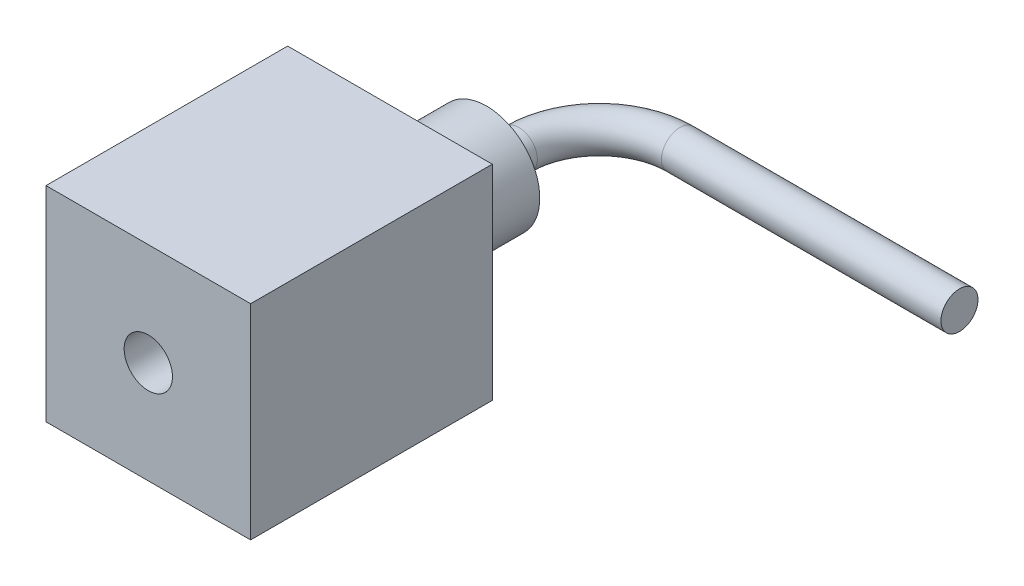
ISO-10303-21;
HEADER;
FILE_DESCRIPTION(('STEP AP214'),'2;1');
FILE_NAME('part.step','',(''),(''),'','','');
FILE_SCHEMA(('AUTOMOTIVE_DESIGN { 1 0 10303 214 1 1 1 1 }'));
ENDSEC;
DATA;
#1=APPLICATION_CONTEXT('core data for automotive mechanical design processes');
#2=APPLICATION_PROTOCOL_DEFINITION('international standard','automotive_design',2000,#1);
#3=PRODUCT_CONTEXT('',#1,'mechanical');
#4=PRODUCT('Part','Part','',(#3));
#5=PRODUCT_RELATED_PRODUCT_CATEGORY('part','',(#4));
#6=PRODUCT_DEFINITION_FORMATION('','',#4);
#7=PRODUCT_DEFINITION_CONTEXT('part definition',#1,'design');
#8=PRODUCT_DEFINITION('design','',#6,#7);
#9=PRODUCT_DEFINITION_SHAPE('','',#8);
#10=(LENGTH_UNIT() NAMED_UNIT(*) SI_UNIT(.MILLI.,.METRE.));
#11=(NAMED_UNIT(*) PLANE_ANGLE_UNIT() SI_UNIT($,.RADIAN.));
#12=(NAMED_UNIT(*) SI_UNIT($,.STERADIAN.) SOLID_ANGLE_UNIT());
#13=UNCERTAINTY_MEASURE_WITH_UNIT(LENGTH_MEASURE(1.E-05),#10,'distance_accuracy_value','');
#14=(GEOMETRIC_REPRESENTATION_CONTEXT(3) GLOBAL_UNCERTAINTY_ASSIGNED_CONTEXT((#13)) GLOBAL_UNIT_ASSIGNED_CONTEXT((#10,
#11,#12)) REPRESENTATION_CONTEXT('',''));
#15=CARTESIAN_POINT('',(0.,0.,0.));
#16=DIRECTION('',(0.,0.,1.));
#17=DIRECTION('',(1.,0.,0.));
#18=AXIS2_PLACEMENT_3D('',#15,#16,#17);
#19=CARTESIAN_POINT('',(-1.27,-1.27,3.));
#20=DIRECTION('',(1.,0.,0.));
#21=DIRECTION('',(0.,0.,-1.));
#22=AXIS2_PLACEMENT_3D('',#19,#20,#21);
#23=PLANE('',#22);
#24=DIRECTION('',(0.,-1.,0.));
#25=VECTOR('',#24,1.);
#26=CARTESIAN_POINT('',(-1.27,-1.27,0.));
#27=LINE('',#26,#25);
#28=CARTESIAN_POINT('',(-1.27,1.27,0.));
#29=VERTEX_POINT('',#28);
#30=CARTESIAN_POINT('',(-1.27,-1.27,0.));
#31=VERTEX_POINT('',#30);
#32=EDGE_CURVE('E101',#29,#31,#27,.T.);
#33=ORIENTED_EDGE('',*,*,#32,.T.);
#34=DIRECTION('',(0.,0.,-1.));
#35=VECTOR('',#34,1.);
#36=CARTESIAN_POINT('',(-1.27,-1.27,3.));
#37=LINE('',#36,#35);
#38=CARTESIAN_POINT('',(-1.27,-1.27,3.));
#39=VERTEX_POINT('',#38);
#40=EDGE_CURVE('E37',#39,#31,#37,.T.);
#41=ORIENTED_EDGE('',*,*,#40,.F.);
#42=DIRECTION('',(0.,-1.,0.));
#43=VECTOR('',#42,1.);
#44=CARTESIAN_POINT('',(-1.27,-1.27,3.));
#45=LINE('',#44,#43);
#46=CARTESIAN_POINT('',(-1.27,1.27,3.));
#47=VERTEX_POINT('',#46);
#48=EDGE_CURVE('E88',#47,#39,#45,.T.);
#49=ORIENTED_EDGE('',*,*,#48,.F.);
#50=DIRECTION('',(0.,0.,-1.));
#51=VECTOR('',#50,1.);
#52=CARTESIAN_POINT('',(-1.27,1.27,3.));
#53=LINE('',#52,#51);
#54=EDGE_CURVE('E97',#47,#29,#53,.T.);
#55=ORIENTED_EDGE('',*,*,#54,.T.);
#56=EDGE_LOOP('',(#33,#41,#49,#55));
#57=FACE_BOUND('',#56,.T.);
#58=ADVANCED_FACE('F34',(#57),#23,.F.);
#59=CARTESIAN_POINT('',(1.27,-1.27,3.));
#60=DIRECTION('',(0.,1.,0.));
#61=DIRECTION('',(-1.,0.,0.));
#62=AXIS2_PLACEMENT_3D('',#59,#60,#61);
#63=PLANE('',#62);
#64=DIRECTION('',(1.,0.,0.));
#65=VECTOR('',#64,1.);
#66=CARTESIAN_POINT('',(1.27,-1.27,0.));
#67=LINE('',#66,#65);
#68=CARTESIAN_POINT('',(1.27,-1.27,0.));
#69=VERTEX_POINT('',#68);
#70=EDGE_CURVE('E93',#31,#69,#67,.T.);
#71=ORIENTED_EDGE('',*,*,#70,.T.);
#72=DIRECTION('',(0.,0.,-1.));
#73=VECTOR('',#72,1.);
#74=CARTESIAN_POINT('',(1.27,-1.27,3.));
#75=LINE('',#74,#73);
#76=CARTESIAN_POINT('',(1.27,-1.27,3.));
#77=VERTEX_POINT('',#76);
#78=EDGE_CURVE('E91',#77,#69,#75,.T.);
#79=ORIENTED_EDGE('',*,*,#78,.F.);
#80=DIRECTION('',(1.,0.,0.));
#81=VECTOR('',#80,1.);
#82=CARTESIAN_POINT('',(1.27,-1.27,3.));
#83=LINE('',#82,#81);
#84=EDGE_CURVE('E83',#39,#77,#83,.T.);
#85=ORIENTED_EDGE('',*,*,#84,.F.);
#86=ORIENTED_EDGE('',*,*,#40,.T.);
#87=EDGE_LOOP('',(#71,#79,#85,#86));
#88=FACE_BOUND('',#87,.T.);
#89=ADVANCED_FACE('F92',(#88),#63,.F.);
#90=CARTESIAN_POINT('',(1.27,-1.27,3.));
#91=DIRECTION('',(-1.,0.,0.));
#92=DIRECTION('',(0.,0.,1.));
#93=AXIS2_PLACEMENT_3D('',#90,#91,#92);
#94=PLANE('',#93);
#95=DIRECTION('',(0.,1.,0.));
#96=VECTOR('',#95,1.);
#97=CARTESIAN_POINT('',(1.27,-1.27,0.));
#98=LINE('',#97,#96);
#99=CARTESIAN_POINT('',(1.27,1.27,0.));
#100=VERTEX_POINT('',#99);
#101=EDGE_CURVE('E69',#69,#100,#98,.T.);
#102=ORIENTED_EDGE('',*,*,#101,.T.);
#103=DIRECTION('',(0.,0.,-1.));
#104=VECTOR('',#103,1.);
#105=CARTESIAN_POINT('',(1.27,1.27,3.));
#106=LINE('',#105,#104);
#107=CARTESIAN_POINT('',(1.27,1.27,3.));
#108=VERTEX_POINT('',#107);
#109=EDGE_CURVE('E94',#108,#100,#106,.T.);
#110=ORIENTED_EDGE('',*,*,#109,.F.);
#111=DIRECTION('',(0.,1.,0.));
#112=VECTOR('',#111,1.);
#113=CARTESIAN_POINT('',(1.27,-1.27,3.));
#114=LINE('',#113,#112);
#115=EDGE_CURVE('E86',#77,#108,#114,.T.);
#116=ORIENTED_EDGE('',*,*,#115,.F.);
#117=ORIENTED_EDGE('',*,*,#78,.T.);
#118=EDGE_LOOP('',(#102,#110,#116,#117));
#119=FACE_BOUND('',#118,.T.);
#120=ADVANCED_FACE('F95',(#119),#94,.F.);
#121=CARTESIAN_POINT('',(1.27,1.27,3.));
#122=DIRECTION('',(0.,-1.,0.));
#123=DIRECTION('',(1.,0.,0.));
#124=AXIS2_PLACEMENT_3D('',#121,#122,#123);
#125=PLANE('',#124);
#126=DIRECTION('',(-1.,0.,0.));
#127=VECTOR('',#126,1.);
#128=CARTESIAN_POINT('',(1.27,1.27,0.));
#129=LINE('',#128,#127);
#130=EDGE_CURVE('E75',#100,#29,#129,.T.);
#131=ORIENTED_EDGE('',*,*,#130,.T.);
#132=ORIENTED_EDGE('',*,*,#54,.F.);
#133=DIRECTION('',(-1.,0.,0.));
#134=VECTOR('',#133,1.);
#135=CARTESIAN_POINT('',(1.27,1.27,3.));
#136=LINE('',#135,#134);
#137=EDGE_CURVE('E52',#108,#47,#136,.T.);
#138=ORIENTED_EDGE('',*,*,#137,.F.);
#139=ORIENTED_EDGE('',*,*,#109,.T.);
#140=EDGE_LOOP('',(#131,#132,#138,#139));
#141=FACE_BOUND('',#140,.T.);
#142=ADVANCED_FACE('F109',(#141),#125,.F.);
#143=CARTESIAN_POINT('',(0.,0.,3.));
#144=DIRECTION('',(0.,0.,1.));
#145=DIRECTION('',(1.,0.,0.));
#146=AXIS2_PLACEMENT_3D('',#143,#144,#145);
#147=PLANE('',#146);
#148=CARTESIAN_POINT('',(0.,0.,3.));
#149=DIRECTION('',(0.,0.,1.));
#150=DIRECTION('',(1.,0.,0.));
#151=AXIS2_PLACEMENT_3D('',#148,#149,#150);
#152=CIRCLE('',#151,0.3);
#153=CARTESIAN_POINT('',(0.3,0.,3.));
#154=VERTEX_POINT('',#153);
#155=EDGE_CURVE('E120',#154,#154,#152,.T.);
#156=ORIENTED_EDGE('',*,*,#155,.F.);
#157=EDGE_LOOP('',(#156));
#158=FACE_BOUND('',#157,.T.);
#159=ORIENTED_EDGE('',*,*,#48,.T.);
#160=ORIENTED_EDGE('',*,*,#84,.T.);
#161=ORIENTED_EDGE('',*,*,#115,.T.);
#162=ORIENTED_EDGE('',*,*,#137,.T.);
#163=EDGE_LOOP('',(#159,#160,#161,#162));
#164=FACE_BOUND('',#163,.T.);
#165=ADVANCED_FACE('F84',(#158,#164),#147,.T.);
#166=CARTESIAN_POINT('',(0.,0.,0.));
#167=DIRECTION('',(0.,0.,1.));
#168=DIRECTION('',(1.,0.,0.));
#169=AXIS2_PLACEMENT_3D('',#166,#167,#168);
#170=PLANE('',#169);
#171=CARTESIAN_POINT('',(0.,0.,0.));
#172=DIRECTION('',(0.,0.,-1.));
#173=DIRECTION('',(-1.,0.,0.));
#174=AXIS2_PLACEMENT_3D('',#171,#172,#173);
#175=CIRCLE('',#174,0.66);
#176=CARTESIAN_POINT('',(-0.66,0.,0.));
#177=VERTEX_POINT('',#176);
#178=EDGE_CURVE('E43',#177,#177,#175,.T.);
#179=ORIENTED_EDGE('',*,*,#178,.F.);
#180=EDGE_LOOP('',(#179));
#181=FACE_BOUND('',#180,.T.);
#182=ORIENTED_EDGE('',*,*,#32,.F.);
#183=ORIENTED_EDGE('',*,*,#130,.F.);
#184=ORIENTED_EDGE('',*,*,#101,.F.);
#185=ORIENTED_EDGE('',*,*,#70,.F.);
#186=EDGE_LOOP('',(#182,#183,#184,#185));
#187=FACE_BOUND('',#186,.T.);
#188=ADVANCED_FACE('F112',(#181,#187),#170,.F.);
#189=CARTESIAN_POINT('',(0.,0.,-1.2));
#190=DIRECTION('',(0.,0.,1.));
#191=DIRECTION('',(1.,0.,0.));
#192=AXIS2_PLACEMENT_3D('',#189,#190,#191);
#193=CYLINDRICAL_SURFACE('',#192,0.66);
#194=CARTESIAN_POINT('',(0.,0.,-1.2));
#195=DIRECTION('',(0.,0.,-1.));
#196=DIRECTION('',(-1.,0.,0.));
#197=AXIS2_PLACEMENT_3D('',#194,#195,#196);
#198=CIRCLE('',#197,0.66);
#199=CARTESIAN_POINT('',(-0.66,0.,-1.2));
#200=VERTEX_POINT('',#199);
#201=EDGE_CURVE('E104',#200,#200,#198,.T.);
#202=ORIENTED_EDGE('',*,*,#201,.F.);
#203=EDGE_LOOP('',(#202));
#204=FACE_BOUND('',#203,.T.);
#205=ORIENTED_EDGE('',*,*,#178,.T.);
#206=EDGE_LOOP('',(#205));
#207=FACE_BOUND('',#206,.T.);
#208=ADVANCED_FACE('F148',(#204,#207),#193,.T.);
#209=CARTESIAN_POINT('',(0.,0.,-1.2));
#210=DIRECTION('',(0.,0.,-1.));
#211=DIRECTION('',(-1.,0.,0.));
#212=AXIS2_PLACEMENT_3D('',#209,#210,#211);
#213=PLANE('',#212);
#214=CARTESIAN_POINT('',(0.,0.,-1.2));
#215=DIRECTION('',(0.,0.,-1.));
#216=DIRECTION('',(-1.,0.,0.));
#217=AXIS2_PLACEMENT_3D('',#214,#215,#216);
#218=CIRCLE('',#217,0.23);
#219=CARTESIAN_POINT('',(-0.23,0.,-1.2));
#220=VERTEX_POINT('',#219);
#221=EDGE_CURVE('E11',#220,#220,#218,.T.);
#222=ORIENTED_EDGE('',*,*,#221,.F.);
#223=EDGE_LOOP('',(#222));
#224=FACE_BOUND('',#223,.T.);
#225=ORIENTED_EDGE('',*,*,#201,.T.);
#226=EDGE_LOOP('',(#225));
#227=FACE_BOUND('',#226,.T.);
#228=ADVANCED_FACE('F144',(#224,#227),#213,.T.);
#229=CARTESIAN_POINT('',(0.,0.,-1.));
#230=DIRECTION('',(0.,0.,1.));
#231=DIRECTION('',(1.,0.,0.));
#232=AXIS2_PLACEMENT_3D('',#229,#230,#231);
#233=CYLINDRICAL_SURFACE('',#232,0.3);
#234=CARTESIAN_POINT('',(0.,0.,-1.));
#235=DIRECTION('',(0.,0.,1.));
#236=DIRECTION('',(1.,0.,0.));
#237=AXIS2_PLACEMENT_3D('',#234,#235,#236);
#238=CIRCLE('',#237,0.3);
#239=CARTESIAN_POINT('',(0.3,0.,-1.));
#240=VERTEX_POINT('',#239);
#241=EDGE_CURVE('E119',#240,#240,#238,.T.);
#242=ORIENTED_EDGE('',*,*,#241,.F.);
#243=EDGE_LOOP('',(#242));
#244=FACE_BOUND('',#243,.T.);
#245=ORIENTED_EDGE('',*,*,#155,.T.);
#246=EDGE_LOOP('',(#245));
#247=FACE_BOUND('',#246,.T.);
#248=ADVANCED_FACE('F147',(#244,#247),#233,.F.);
#249=CARTESIAN_POINT('',(0.,0.,-1.));
#250=DIRECTION('',(0.,0.,1.));
#251=DIRECTION('',(1.,0.,0.));
#252=AXIS2_PLACEMENT_3D('',#249,#250,#251);
#253=PLANE('',#252);
#254=ORIENTED_EDGE('',*,*,#241,.T.);
#255=EDGE_LOOP('',(#254));
#256=FACE_BOUND('',#255,.T.);
#257=ADVANCED_FACE('F195',(#256),#253,.T.);
#258=CARTESIAN_POINT('',(4.47,0.,-2.6));
#259=DIRECTION('',(1.,0.,0.));
#260=DIRECTION('',(0.,0.,-1.));
#261=AXIS2_PLACEMENT_3D('',#258,#259,#260);
#262=PLANE('',#261);
#263=CARTESIAN_POINT('',(4.47,0.,-2.6));
#264=DIRECTION('',(1.,0.,0.));
#265=DIRECTION('',(0.,0.,-1.));
#266=AXIS2_PLACEMENT_3D('',#263,#264,#265);
#267=CIRCLE('',#266,0.23);
#268=CARTESIAN_POINT('',(4.47,0.,-2.83));
#269=VERTEX_POINT('',#268);
#270=EDGE_CURVE('E123',#269,#269,#267,.T.);
#271=ORIENTED_EDGE('',*,*,#270,.T.);
#272=EDGE_LOOP('',(#271));
#273=FACE_BOUND('',#272,.T.);
#274=ADVANCED_FACE('F140',(#273),#262,.T.);
#275=CARTESIAN_POINT('',(0.,0.,-1.2));
#276=DIRECTION('',(0.,0.,-1.));
#277=DIRECTION('',(-1.,0.,0.));
#278=AXIS2_PLACEMENT_3D('',#275,#276,#277);
#279=CYLINDRICAL_SURFACE('',#278,0.23);
#280=CARTESIAN_POINT('',(0.,0.,-1.59999999999999));
#281=DIRECTION('',(0.,0.,-1.));
#282=DIRECTION('',(-1.,0.,0.));
#283=AXIS2_PLACEMENT_3D('',#280,#281,#282);
#284=CIRCLE('',#283,0.23);
#285=CARTESIAN_POINT('',(-0.229999999999991,0.,-1.59999999999999));
#286=VERTEX_POINT('',#285);
#287=EDGE_CURVE('E131',#286,#286,#284,.T.);
#288=ORIENTED_EDGE('',*,*,#287,.F.);
#289=EDGE_LOOP('',(#288));
#290=FACE_BOUND('',#289,.T.);
#291=ORIENTED_EDGE('',*,*,#221,.T.);
#292=EDGE_LOOP('',(#291));
#293=FACE_BOUND('',#292,.T.);
#294=ADVANCED_FACE('F137',(#290,#293),#279,.T.);
#295=CARTESIAN_POINT('',(1.,0.,-1.6));
#296=DIRECTION('',(0.,-1.,0.));
#297=DIRECTION('',(0.,0.,-1.));
#298=AXIS2_PLACEMENT_3D('',#295,#296,#297);
#299=TOROIDAL_SURFACE('',#298,0.999999999999991,0.23);
#300=CARTESIAN_POINT('',(1.00000000000001,0.,-2.6));
#301=DIRECTION('',(1.,0.,0.));
#302=DIRECTION('',(0.,0.,-1.));
#303=AXIS2_PLACEMENT_3D('',#300,#301,#302);
#304=CIRCLE('',#303,0.23);
#305=CARTESIAN_POINT('',(1.00000000000001,0.,-2.82999999999999));
#306=VERTEX_POINT('',#305);
#307=EDGE_CURVE('E128',#306,#306,#304,.T.);
#308=CARTESIAN_POINT('',(1.,0.,-1.6));
#309=DIRECTION('',(0.,-1.,0.));
#310=DIRECTION('',(0.,0.,-1.));
#311=AXIS2_PLACEMENT_3D('',#308,#309,#310);
#312=CIRCLE('',#311,1.22999999999999);
#313=EDGE_CURVE('',#286,#306,#312,.T.);
#314=ORIENTED_EDGE('',*,*,#287,.T.);
#315=ORIENTED_EDGE('',*,*,#307,.F.);
#316=ORIENTED_EDGE('',*,*,#313,.T.);
#317=ORIENTED_EDGE('',*,*,#313,.F.);
#318=EDGE_LOOP('',(#314,#316,#315,#317));
#319=FACE_BOUND('',#318,.T.);
#320=ADVANCED_FACE('F135',(#319),#299,.T.);
#321=CARTESIAN_POINT('',(1.00000000000001,0.,-2.6));
#322=DIRECTION('',(1.,0.,0.));
#323=DIRECTION('',(0.,0.,-1.));
#324=AXIS2_PLACEMENT_3D('',#321,#322,#323);
#325=CYLINDRICAL_SURFACE('',#324,0.23);
#326=ORIENTED_EDGE('',*,*,#270,.F.);
#327=EDGE_LOOP('',(#326));
#328=FACE_BOUND('',#327,.T.);
#329=ORIENTED_EDGE('',*,*,#307,.T.);
#330=EDGE_LOOP('',(#329));
#331=FACE_BOUND('',#330,.T.);
#332=ADVANCED_FACE('F208',(#328,#331),#325,.T.);
#333=CLOSED_SHELL('',(#58,#89,#120,#142,#165,#188,#208,#228,#248,#257,#274,#294,#320,#332));
#334=MANIFOLD_SOLID_BREP('B2',#333);
#335=ADVANCED_BREP_SHAPE_REPRESENTATION('',(#18,#334),#14);
#336=SHAPE_DEFINITION_REPRESENTATION(#9,#335);
ENDSEC;
END-ISO-10303-21;
